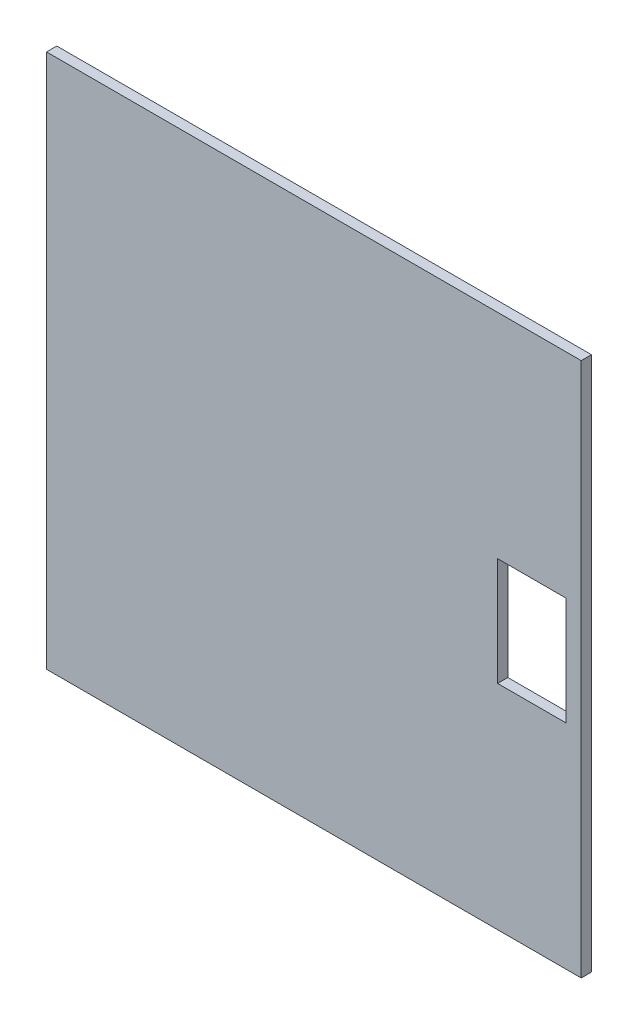
ISO-10303-21;
HEADER;
FILE_DESCRIPTION(('STEP AP214'),'2;1');
FILE_NAME('part.step','',(''),(''),'','','');
FILE_SCHEMA(('AUTOMOTIVE_DESIGN { 1 0 10303 214 1 1 1 1 }'));
ENDSEC;
DATA;
#1=APPLICATION_CONTEXT('core data for automotive mechanical design processes');
#2=APPLICATION_PROTOCOL_DEFINITION('international standard','automotive_design',2000,#1);
#3=PRODUCT_CONTEXT('',#1,'mechanical');
#4=PRODUCT('Part','Part','',(#3));
#5=PRODUCT_RELATED_PRODUCT_CATEGORY('part','',(#4));
#6=PRODUCT_DEFINITION_FORMATION('','',#4);
#7=PRODUCT_DEFINITION_CONTEXT('part definition',#1,'design');
#8=PRODUCT_DEFINITION('design','',#6,#7);
#9=PRODUCT_DEFINITION_SHAPE('','',#8);
#10=(LENGTH_UNIT() NAMED_UNIT(*) SI_UNIT(.MILLI.,.METRE.));
#11=(NAMED_UNIT(*) PLANE_ANGLE_UNIT() SI_UNIT($,.RADIAN.));
#12=(NAMED_UNIT(*) SI_UNIT($,.STERADIAN.) SOLID_ANGLE_UNIT());
#13=UNCERTAINTY_MEASURE_WITH_UNIT(LENGTH_MEASURE(1.E-05),#10,'distance_accuracy_value','');
#14=(GEOMETRIC_REPRESENTATION_CONTEXT(3) GLOBAL_UNCERTAINTY_ASSIGNED_CONTEXT((#13)) GLOBAL_UNIT_ASSIGNED_CONTEXT((#10,
#11,#12)) REPRESENTATION_CONTEXT('',''));
#15=CARTESIAN_POINT('',(0.,0.,0.));
#16=DIRECTION('',(0.,0.,1.));
#17=DIRECTION('',(1.,0.,0.));
#18=AXIS2_PLACEMENT_3D('',#15,#16,#17);
#19=CARTESIAN_POINT('',(0.,0.,-9.));
#20=DIRECTION('',(-1.,0.,0.));
#21=DIRECTION('',(0.,0.,1.));
#22=AXIS2_PLACEMENT_3D('',#19,#20,#21);
#23=PLANE('',#22);
#24=DIRECTION('',(0.,-1.,0.));
#25=VECTOR('',#24,1.);
#26=CARTESIAN_POINT('',(0.,0.,0.));
#27=LINE('',#26,#25);
#28=CARTESIAN_POINT('',(0.,470.,0.));
#29=VERTEX_POINT('',#28);
#30=CARTESIAN_POINT('',(0.,0.,0.));
#31=VERTEX_POINT('',#30);
#32=EDGE_CURVE('E133',#29,#31,#27,.T.);
#33=ORIENTED_EDGE('',*,*,#32,.F.);
#34=DIRECTION('',(0.,0.,1.));
#35=VECTOR('',#34,1.);
#36=CARTESIAN_POINT('',(0.,470.,-9.));
#37=LINE('',#36,#35);
#38=CARTESIAN_POINT('',(0.,470.,-9.));
#39=VERTEX_POINT('',#38);
#40=EDGE_CURVE('E11',#39,#29,#37,.T.);
#41=ORIENTED_EDGE('',*,*,#40,.F.);
#42=DIRECTION('',(0.,-1.,0.));
#43=VECTOR('',#42,1.);
#44=CARTESIAN_POINT('',(0.,0.,-9.));
#45=LINE('',#44,#43);
#46=CARTESIAN_POINT('',(0.,0.,-9.));
#47=VERTEX_POINT('',#46);
#48=EDGE_CURVE('E134',#39,#47,#45,.T.);
#49=ORIENTED_EDGE('',*,*,#48,.T.);
#50=DIRECTION('',(0.,0.,1.));
#51=VECTOR('',#50,1.);
#52=CARTESIAN_POINT('',(0.,0.,-9.));
#53=LINE('',#52,#51);
#54=EDGE_CURVE('E36',#47,#31,#53,.T.);
#55=ORIENTED_EDGE('',*,*,#54,.T.);
#56=EDGE_LOOP('',(#33,#41,#49,#55));
#57=FACE_BOUND('',#56,.T.);
#58=ADVANCED_FACE('F33',(#57),#23,.T.);
#59=CARTESIAN_POINT('',(0.,470.,-9.));
#60=DIRECTION('',(0.,1.,0.));
#61=DIRECTION('',(0.,0.,1.));
#62=AXIS2_PLACEMENT_3D('',#59,#60,#61);
#63=PLANE('',#62);
#64=DIRECTION('',(-1.,0.,0.));
#65=VECTOR('',#64,1.);
#66=CARTESIAN_POINT('',(0.,470.,0.));
#67=LINE('',#66,#65);
#68=CARTESIAN_POINT('',(470.,470.,0.));
#69=VERTEX_POINT('',#68);
#70=EDGE_CURVE('E138',#69,#29,#67,.T.);
#71=ORIENTED_EDGE('',*,*,#70,.F.);
#72=DIRECTION('',(0.,0.,1.));
#73=VECTOR('',#72,1.);
#74=CARTESIAN_POINT('',(470.,470.,-9.));
#75=LINE('',#74,#73);
#76=CARTESIAN_POINT('',(470.,470.,-9.));
#77=VERTEX_POINT('',#76);
#78=EDGE_CURVE('E41',#77,#69,#75,.T.);
#79=ORIENTED_EDGE('',*,*,#78,.F.);
#80=DIRECTION('',(-1.,0.,0.));
#81=VECTOR('',#80,1.);
#82=CARTESIAN_POINT('',(0.,470.,-9.));
#83=LINE('',#82,#81);
#84=EDGE_CURVE('E144',#77,#39,#83,.T.);
#85=ORIENTED_EDGE('',*,*,#84,.T.);
#86=ORIENTED_EDGE('',*,*,#40,.T.);
#87=EDGE_LOOP('',(#71,#79,#85,#86));
#88=FACE_BOUND('',#87,.T.);
#89=ADVANCED_FACE('F168',(#88),#63,.T.);
#90=CARTESIAN_POINT('',(470.,0.,-9.));
#91=DIRECTION('',(1.,0.,0.));
#92=DIRECTION('',(0.,0.,-1.));
#93=AXIS2_PLACEMENT_3D('',#90,#91,#92);
#94=PLANE('',#93);
#95=DIRECTION('',(0.,1.,0.));
#96=VECTOR('',#95,1.);
#97=CARTESIAN_POINT('',(470.,0.,0.));
#98=LINE('',#97,#96);
#99=CARTESIAN_POINT('',(470.,0.,0.));
#100=VERTEX_POINT('',#99);
#101=EDGE_CURVE('E152',#100,#69,#98,.T.);
#102=ORIENTED_EDGE('',*,*,#101,.F.);
#103=DIRECTION('',(0.,0.,1.));
#104=VECTOR('',#103,1.);
#105=CARTESIAN_POINT('',(470.,0.,-9.));
#106=LINE('',#105,#104);
#107=CARTESIAN_POINT('',(470.,0.,-9.));
#108=VERTEX_POINT('',#107);
#109=EDGE_CURVE('E157',#108,#100,#106,.T.);
#110=ORIENTED_EDGE('',*,*,#109,.F.);
#111=DIRECTION('',(0.,1.,0.));
#112=VECTOR('',#111,1.);
#113=CARTESIAN_POINT('',(470.,0.,-9.));
#114=LINE('',#113,#112);
#115=EDGE_CURVE('E141',#108,#77,#114,.T.);
#116=ORIENTED_EDGE('',*,*,#115,.T.);
#117=ORIENTED_EDGE('',*,*,#78,.T.);
#118=EDGE_LOOP('',(#102,#110,#116,#117));
#119=FACE_BOUND('',#118,.T.);
#120=ADVANCED_FACE('F174',(#119),#94,.T.);
#121=CARTESIAN_POINT('',(0.,0.,-9.));
#122=DIRECTION('',(0.,-1.,0.));
#123=DIRECTION('',(0.,0.,-1.));
#124=AXIS2_PLACEMENT_3D('',#121,#122,#123);
#125=PLANE('',#124);
#126=DIRECTION('',(1.,0.,0.));
#127=VECTOR('',#126,1.);
#128=CARTESIAN_POINT('',(0.,0.,0.));
#129=LINE('',#128,#127);
#130=EDGE_CURVE('E149',#31,#100,#129,.T.);
#131=ORIENTED_EDGE('',*,*,#130,.F.);
#132=ORIENTED_EDGE('',*,*,#54,.F.);
#133=DIRECTION('',(1.,0.,0.));
#134=VECTOR('',#133,1.);
#135=CARTESIAN_POINT('',(0.,0.,-9.));
#136=LINE('',#135,#134);
#137=EDGE_CURVE('E137',#47,#108,#136,.T.);
#138=ORIENTED_EDGE('',*,*,#137,.T.);
#139=ORIENTED_EDGE('',*,*,#109,.T.);
#140=EDGE_LOOP('',(#131,#132,#138,#139));
#141=FACE_BOUND('',#140,.T.);
#142=ADVANCED_FACE('F165',(#141),#125,.T.);
#143=CARTESIAN_POINT('',(0.,0.,-9.));
#144=DIRECTION('',(0.,0.,-1.));
#145=DIRECTION('',(-1.,0.,0.));
#146=AXIS2_PLACEMENT_3D('',#143,#144,#145);
#147=PLANE('',#146);
#148=DIRECTION('',(0.,1.,0.));
#149=VECTOR('',#148,1.);
#150=CARTESIAN_POINT('',(396.5,0.,-9.));
#151=LINE('',#150,#149);
#152=CARTESIAN_POINT('',(396.5,187.5,-9.));
#153=VERTEX_POINT('',#152);
#154=CARTESIAN_POINT('',(396.5,282.5,-9.));
#155=VERTEX_POINT('',#154);
#156=EDGE_CURVE('E131',#153,#155,#151,.T.);
#157=ORIENTED_EDGE('',*,*,#156,.F.);
#158=DIRECTION('',(-1.,0.,0.));
#159=VECTOR('',#158,1.);
#160=CARTESIAN_POINT('',(0.,187.5,-9.));
#161=LINE('',#160,#159);
#162=CARTESIAN_POINT('',(456.5,187.5,-9.));
#163=VERTEX_POINT('',#162);
#164=EDGE_CURVE('E124',#163,#153,#161,.T.);
#165=ORIENTED_EDGE('',*,*,#164,.F.);
#166=DIRECTION('',(0.,-1.,0.));
#167=VECTOR('',#166,1.);
#168=CARTESIAN_POINT('',(456.5,0.,-9.));
#169=LINE('',#168,#167);
#170=CARTESIAN_POINT('',(456.5,282.5,-9.));
#171=VERTEX_POINT('',#170);
#172=EDGE_CURVE('E104',#171,#163,#169,.T.);
#173=ORIENTED_EDGE('',*,*,#172,.F.);
#174=DIRECTION('',(1.,0.,0.));
#175=VECTOR('',#174,1.);
#176=CARTESIAN_POINT('',(0.,282.5,-9.));
#177=LINE('',#176,#175);
#178=EDGE_CURVE('E129',#155,#171,#177,.T.);
#179=ORIENTED_EDGE('',*,*,#178,.F.);
#180=EDGE_LOOP('',(#157,#165,#173,#179));
#181=FACE_BOUND('',#180,.T.);
#182=ORIENTED_EDGE('',*,*,#48,.F.);
#183=ORIENTED_EDGE('',*,*,#84,.F.);
#184=ORIENTED_EDGE('',*,*,#115,.F.);
#185=ORIENTED_EDGE('',*,*,#137,.F.);
#186=EDGE_LOOP('',(#182,#183,#184,#185));
#187=FACE_BOUND('',#186,.T.);
#188=ADVANCED_FACE('F171',(#181,#187),#147,.T.);
#189=CARTESIAN_POINT('',(0.,0.,0.));
#190=DIRECTION('',(0.,0.,-1.));
#191=DIRECTION('',(-1.,0.,0.));
#192=AXIS2_PLACEMENT_3D('',#189,#190,#191);
#193=PLANE('',#192);
#194=DIRECTION('',(1.,0.,0.));
#195=VECTOR('',#194,1.);
#196=CARTESIAN_POINT('',(396.5,187.5,0.));
#197=LINE('',#196,#195);
#198=CARTESIAN_POINT('',(396.5,187.5,0.));
#199=VERTEX_POINT('',#198);
#200=CARTESIAN_POINT('',(456.5,187.5,0.));
#201=VERTEX_POINT('',#200);
#202=EDGE_CURVE('E110',#199,#201,#197,.T.);
#203=ORIENTED_EDGE('',*,*,#202,.F.);
#204=DIRECTION('',(0.,-1.,0.));
#205=VECTOR('',#204,1.);
#206=CARTESIAN_POINT('',(396.5,282.5,0.));
#207=LINE('',#206,#205);
#208=CARTESIAN_POINT('',(396.5,282.5,0.));
#209=VERTEX_POINT('',#208);
#210=EDGE_CURVE('E57',#209,#199,#207,.T.);
#211=ORIENTED_EDGE('',*,*,#210,.F.);
#212=DIRECTION('',(-1.,0.,0.));
#213=VECTOR('',#212,1.);
#214=CARTESIAN_POINT('',(396.5,282.5,0.));
#215=LINE('',#214,#213);
#216=CARTESIAN_POINT('',(456.5,282.5,0.));
#217=VERTEX_POINT('',#216);
#218=EDGE_CURVE('E117',#217,#209,#215,.T.);
#219=ORIENTED_EDGE('',*,*,#218,.F.);
#220=DIRECTION('',(0.,1.,0.));
#221=VECTOR('',#220,1.);
#222=CARTESIAN_POINT('',(456.5,282.5,0.));
#223=LINE('',#222,#221);
#224=EDGE_CURVE('E101',#201,#217,#223,.T.);
#225=ORIENTED_EDGE('',*,*,#224,.F.);
#226=EDGE_LOOP('',(#203,#211,#219,#225));
#227=FACE_BOUND('',#226,.T.);
#228=ORIENTED_EDGE('',*,*,#32,.T.);
#229=ORIENTED_EDGE('',*,*,#130,.T.);
#230=ORIENTED_EDGE('',*,*,#101,.T.);
#231=ORIENTED_EDGE('',*,*,#70,.T.);
#232=EDGE_LOOP('',(#228,#229,#230,#231));
#233=FACE_BOUND('',#232,.T.);
#234=ADVANCED_FACE('F114',(#227,#233),#193,.F.);
#235=CARTESIAN_POINT('',(396.5,282.5,-10.));
#236=DIRECTION('',(-1.,0.,0.));
#237=DIRECTION('',(0.,0.,1.));
#238=AXIS2_PLACEMENT_3D('',#235,#236,#237);
#239=PLANE('',#238);
#240=ORIENTED_EDGE('',*,*,#156,.T.);
#241=DIRECTION('',(0.,0.,1.));
#242=VECTOR('',#241,1.);
#243=CARTESIAN_POINT('',(396.5,282.5,-10.));
#244=LINE('',#243,#242);
#245=EDGE_CURVE('E122',#155,#209,#244,.T.);
#246=ORIENTED_EDGE('',*,*,#245,.T.);
#247=ORIENTED_EDGE('',*,*,#210,.T.);
#248=DIRECTION('',(0.,0.,1.));
#249=VECTOR('',#248,1.);
#250=CARTESIAN_POINT('',(396.5,187.5,-10.));
#251=LINE('',#250,#249);
#252=EDGE_CURVE('E107',#153,#199,#251,.T.);
#253=ORIENTED_EDGE('',*,*,#252,.F.);
#254=EDGE_LOOP('',(#240,#246,#247,#253));
#255=FACE_BOUND('',#254,.T.);
#256=ADVANCED_FACE('F217',(#255),#239,.F.);
#257=CARTESIAN_POINT('',(396.5,282.5,-10.));
#258=DIRECTION('',(0.,1.,0.));
#259=DIRECTION('',(0.,0.,1.));
#260=AXIS2_PLACEMENT_3D('',#257,#258,#259);
#261=PLANE('',#260);
#262=ORIENTED_EDGE('',*,*,#178,.T.);
#263=DIRECTION('',(0.,0.,1.));
#264=VECTOR('',#263,1.);
#265=CARTESIAN_POINT('',(456.5,282.5,-10.));
#266=LINE('',#265,#264);
#267=EDGE_CURVE('E106',#171,#217,#266,.T.);
#268=ORIENTED_EDGE('',*,*,#267,.T.);
#269=ORIENTED_EDGE('',*,*,#218,.T.);
#270=ORIENTED_EDGE('',*,*,#245,.F.);
#271=EDGE_LOOP('',(#262,#268,#269,#270));
#272=FACE_BOUND('',#271,.T.);
#273=ADVANCED_FACE('F226',(#272),#261,.F.);
#274=CARTESIAN_POINT('',(456.5,282.5,-10.));
#275=DIRECTION('',(1.,0.,0.));
#276=DIRECTION('',(0.,0.,-1.));
#277=AXIS2_PLACEMENT_3D('',#274,#275,#276);
#278=PLANE('',#277);
#279=ORIENTED_EDGE('',*,*,#172,.T.);
#280=DIRECTION('',(0.,0.,1.));
#281=VECTOR('',#280,1.);
#282=CARTESIAN_POINT('',(456.5,187.5,-10.));
#283=LINE('',#282,#281);
#284=EDGE_CURVE('E49',#163,#201,#283,.T.);
#285=ORIENTED_EDGE('',*,*,#284,.T.);
#286=ORIENTED_EDGE('',*,*,#224,.T.);
#287=ORIENTED_EDGE('',*,*,#267,.F.);
#288=EDGE_LOOP('',(#279,#285,#286,#287));
#289=FACE_BOUND('',#288,.T.);
#290=ADVANCED_FACE('F98',(#289),#278,.F.);
#291=CARTESIAN_POINT('',(396.5,187.5,-10.));
#292=DIRECTION('',(0.,-1.,0.));
#293=DIRECTION('',(0.,0.,-1.));
#294=AXIS2_PLACEMENT_3D('',#291,#292,#293);
#295=PLANE('',#294);
#296=ORIENTED_EDGE('',*,*,#164,.T.);
#297=ORIENTED_EDGE('',*,*,#252,.T.);
#298=ORIENTED_EDGE('',*,*,#202,.T.);
#299=ORIENTED_EDGE('',*,*,#284,.F.);
#300=EDGE_LOOP('',(#296,#297,#298,#299));
#301=FACE_BOUND('',#300,.T.);
#302=ADVANCED_FACE('F111',(#301),#295,.F.);
#303=CLOSED_SHELL('',(#58,#89,#120,#142,#188,#234,#256,#273,#290,#302));
#304=MANIFOLD_SOLID_BREP('B2',#303);
#305=ADVANCED_BREP_SHAPE_REPRESENTATION('',(#18,#304),#14);
#306=SHAPE_DEFINITION_REPRESENTATION(#9,#305);
ENDSEC;
END-ISO-10303-21;
